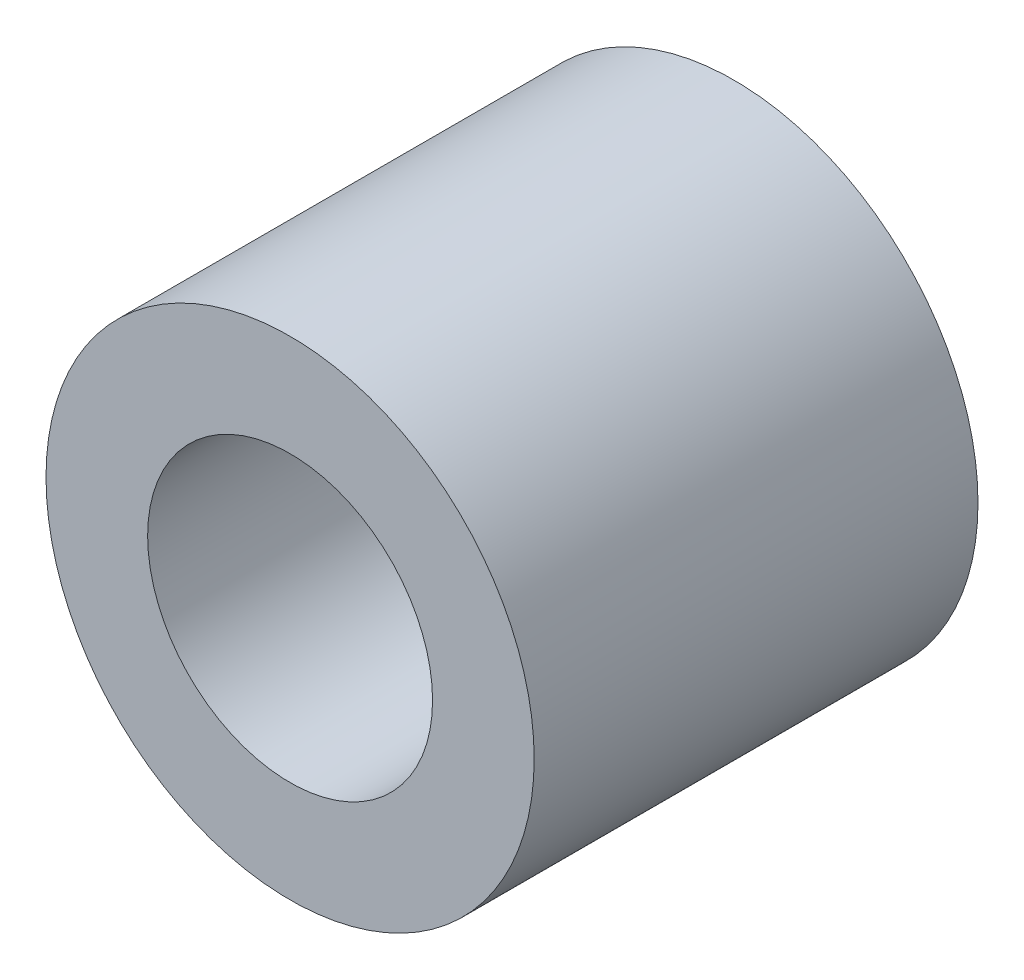
ISO-10303-21;
HEADER;
FILE_DESCRIPTION(('STEP AP214'),'2;1');
FILE_NAME('part.step','',(''),(''),'','','');
FILE_SCHEMA(('AUTOMOTIVE_DESIGN { 1 0 10303 214 1 1 1 1 }'));
ENDSEC;
DATA;
#1=APPLICATION_CONTEXT('core data for automotive mechanical design processes');
#2=APPLICATION_PROTOCOL_DEFINITION('international standard','automotive_design',2000,#1);
#3=PRODUCT_CONTEXT('',#1,'mechanical');
#4=PRODUCT('Part','Part','',(#3));
#5=PRODUCT_RELATED_PRODUCT_CATEGORY('part','',(#4));
#6=PRODUCT_DEFINITION_FORMATION('','',#4);
#7=PRODUCT_DEFINITION_CONTEXT('part definition',#1,'design');
#8=PRODUCT_DEFINITION('design','',#6,#7);
#9=PRODUCT_DEFINITION_SHAPE('','',#8);
#10=(LENGTH_UNIT() NAMED_UNIT(*) SI_UNIT(.MILLI.,.METRE.));
#11=(NAMED_UNIT(*) PLANE_ANGLE_UNIT() SI_UNIT($,.RADIAN.));
#12=(NAMED_UNIT(*) SI_UNIT($,.STERADIAN.) SOLID_ANGLE_UNIT());
#13=UNCERTAINTY_MEASURE_WITH_UNIT(LENGTH_MEASURE(1.E-05),#10,'distance_accuracy_value','');
#14=(GEOMETRIC_REPRESENTATION_CONTEXT(3) GLOBAL_UNCERTAINTY_ASSIGNED_CONTEXT((#13)) GLOBAL_UNIT_ASSIGNED_CONTEXT((#10,
#11,#12)) REPRESENTATION_CONTEXT('',''));
#15=CARTESIAN_POINT('',(0.,0.,0.));
#16=DIRECTION('',(0.,0.,1.));
#17=DIRECTION('',(1.,0.,0.));
#18=AXIS2_PLACEMENT_3D('',#15,#16,#17);
#19=CARTESIAN_POINT('',(0.,0.,20.));
#20=DIRECTION('',(0.,0.,-1.));
#21=DIRECTION('',(-1.,0.,0.));
#22=AXIS2_PLACEMENT_3D('',#19,#20,#21);
#23=CYLINDRICAL_SURFACE('',#22,27.5);
#24=CARTESIAN_POINT('',(0.,0.,0.));
#25=DIRECTION('',(0.,0.,1.));
#26=DIRECTION('',(1.,0.,0.));
#27=AXIS2_PLACEMENT_3D('',#24,#25,#26);
#28=CIRCLE('',#27,27.5);
#29=CARTESIAN_POINT('',(27.5,0.,0.));
#30=VERTEX_POINT('',#29);
#31=EDGE_CURVE('E10',#30,#30,#28,.T.);
#32=ORIENTED_EDGE('',*,*,#31,.T.);
#33=EDGE_LOOP('',(#32));
#34=FACE_BOUND('',#33,.T.);
#35=CARTESIAN_POINT('',(0.,0.,50.));
#36=DIRECTION('',(0.,0.,1.));
#37=DIRECTION('',(1.,0.,0.));
#38=AXIS2_PLACEMENT_3D('',#35,#36,#37);
#39=CIRCLE('',#38,27.5);
#40=CARTESIAN_POINT('',(27.5,0.,50.));
#41=VERTEX_POINT('',#40);
#42=EDGE_CURVE('E37',#41,#41,#39,.T.);
#43=ORIENTED_EDGE('',*,*,#42,.F.);
#44=EDGE_LOOP('',(#43));
#45=FACE_BOUND('',#44,.T.);
#46=ADVANCED_FACE('F31',(#34,#45),#23,.T.);
#47=CARTESIAN_POINT('',(0.,0.,0.));
#48=DIRECTION('',(0.,0.,1.));
#49=DIRECTION('',(1.,0.,0.));
#50=AXIS2_PLACEMENT_3D('',#47,#48,#49);
#51=PLANE('',#50);
#52=CARTESIAN_POINT('',(0.,0.,0.));
#53=DIRECTION('',(0.,0.,-1.));
#54=DIRECTION('',(-1.,0.,0.));
#55=AXIS2_PLACEMENT_3D('',#52,#53,#54);
#56=CIRCLE('',#55,16.05);
#57=CARTESIAN_POINT('',(-16.05,0.,0.));
#58=VERTEX_POINT('',#57);
#59=EDGE_CURVE('E45',#58,#58,#56,.T.);
#60=ORIENTED_EDGE('',*,*,#59,.F.);
#61=EDGE_LOOP('',(#60));
#62=FACE_BOUND('',#61,.T.);
#63=ORIENTED_EDGE('',*,*,#31,.F.);
#64=EDGE_LOOP('',(#63));
#65=FACE_BOUND('',#64,.T.);
#66=ADVANCED_FACE('F53',(#62,#65),#51,.F.);
#67=CARTESIAN_POINT('',(0.,0.,50.));
#68=DIRECTION('',(0.,0.,1.));
#69=DIRECTION('',(1.,0.,0.));
#70=AXIS2_PLACEMENT_3D('',#67,#68,#69);
#71=PLANE('',#70);
#72=CARTESIAN_POINT('',(0.,0.,50.));
#73=DIRECTION('',(0.,0.,-1.));
#74=DIRECTION('',(-1.,0.,0.));
#75=AXIS2_PLACEMENT_3D('',#72,#73,#74);
#76=CIRCLE('',#75,16.05);
#77=CARTESIAN_POINT('',(-16.05,0.,50.));
#78=VERTEX_POINT('',#77);
#79=EDGE_CURVE('E41',#78,#78,#76,.T.);
#80=ORIENTED_EDGE('',*,*,#79,.T.);
#81=EDGE_LOOP('',(#80));
#82=FACE_BOUND('',#81,.T.);
#83=ORIENTED_EDGE('',*,*,#42,.T.);
#84=EDGE_LOOP('',(#83));
#85=FACE_BOUND('',#84,.T.);
#86=ADVANCED_FACE('F56',(#82,#85),#71,.T.);
#87=CARTESIAN_POINT('',(0.,0.,50.));
#88=DIRECTION('',(0.,0.,-1.));
#89=DIRECTION('',(-1.,0.,0.));
#90=AXIS2_PLACEMENT_3D('',#87,#88,#89);
#91=CYLINDRICAL_SURFACE('',#90,16.05);
#92=ORIENTED_EDGE('',*,*,#79,.F.);
#93=EDGE_LOOP('',(#92));
#94=FACE_BOUND('',#93,.T.);
#95=ORIENTED_EDGE('',*,*,#59,.T.);
#96=EDGE_LOOP('',(#95));
#97=FACE_BOUND('',#96,.T.);
#98=ADVANCED_FACE('F51',(#94,#97),#91,.F.);
#99=CLOSED_SHELL('',(#46,#66,#86,#98));
#100=MANIFOLD_SOLID_BREP('B2',#99);
#101=ADVANCED_BREP_SHAPE_REPRESENTATION('',(#18,#100),#14);
#102=SHAPE_DEFINITION_REPRESENTATION(#9,#101);
ENDSEC;
END-ISO-10303-21;
